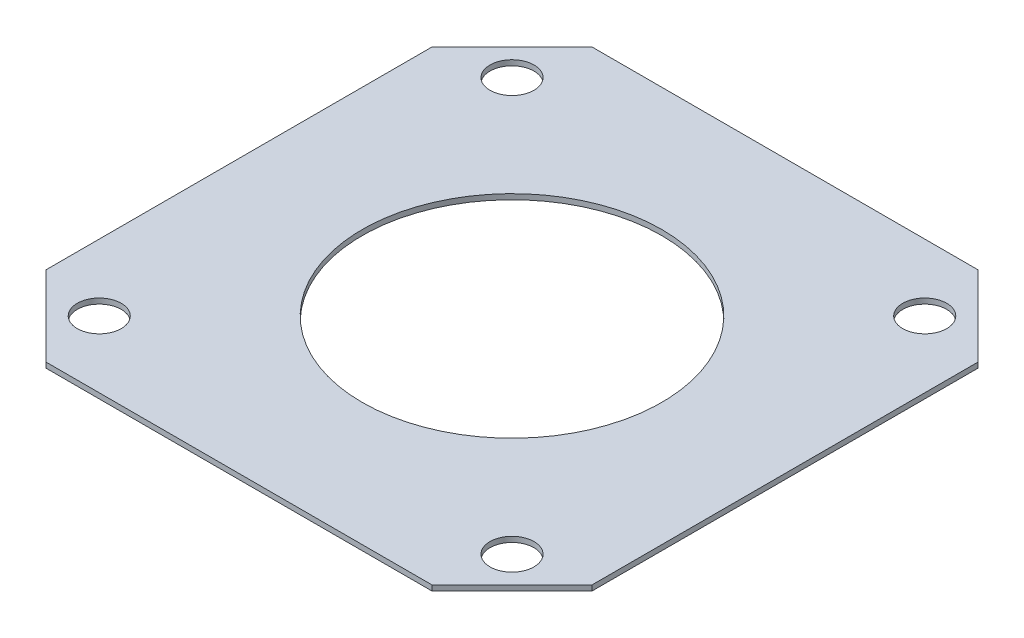
ISO-10303-21;
HEADER;
FILE_DESCRIPTION(('STEP AP214'),'2;1');
FILE_NAME('part.step','',(''),(''),'','','');
FILE_SCHEMA(('AUTOMOTIVE_DESIGN { 1 0 10303 214 1 1 1 1 }'));
ENDSEC;
DATA;
#1=APPLICATION_CONTEXT('core data for automotive mechanical design processes');
#2=APPLICATION_PROTOCOL_DEFINITION('international standard','automotive_design',2000,#1);
#3=PRODUCT_CONTEXT('',#1,'mechanical');
#4=PRODUCT('Part','Part','',(#3));
#5=PRODUCT_RELATED_PRODUCT_CATEGORY('part','',(#4));
#6=PRODUCT_DEFINITION_FORMATION('','',#4);
#7=PRODUCT_DEFINITION_CONTEXT('part definition',#1,'design');
#8=PRODUCT_DEFINITION('design','',#6,#7);
#9=PRODUCT_DEFINITION_SHAPE('','',#8);
#10=(LENGTH_UNIT() NAMED_UNIT(*) SI_UNIT(.MILLI.,.METRE.));
#11=(NAMED_UNIT(*) PLANE_ANGLE_UNIT() SI_UNIT($,.RADIAN.));
#12=(NAMED_UNIT(*) SI_UNIT($,.STERADIAN.) SOLID_ANGLE_UNIT());
#13=UNCERTAINTY_MEASURE_WITH_UNIT(LENGTH_MEASURE(1.E-05),#10,'distance_accuracy_value','');
#14=(GEOMETRIC_REPRESENTATION_CONTEXT(3) GLOBAL_UNCERTAINTY_ASSIGNED_CONTEXT((#13)) GLOBAL_UNIT_ASSIGNED_CONTEXT((#10,
#11,#12)) REPRESENTATION_CONTEXT('',''));
#15=CARTESIAN_POINT('',(0.,0.,0.));
#16=DIRECTION('',(0.,0.,1.));
#17=DIRECTION('',(1.,0.,0.));
#18=AXIS2_PLACEMENT_3D('',#15,#16,#17);
#19=CARTESIAN_POINT('',(0.,0.4,0.));
#20=DIRECTION('',(0.,1.,0.));
#21=DIRECTION('',(0.,0.,1.));
#22=AXIS2_PLACEMENT_3D('',#19,#20,#21);
#23=PLANE('',#22);
#24=CARTESIAN_POINT('',(15.4999999999999,0.4,-15.5000000000001));
#25=DIRECTION('',(0.,1.,0.));
#26=DIRECTION('',(0.,0.,1.));
#27=AXIS2_PLACEMENT_3D('',#24,#25,#26);
#28=CIRCLE('',#27,1.65000000000013);
#29=CARTESIAN_POINT('',(15.4999999999999,0.4,-13.85));
#30=VERTEX_POINT('',#29);
#31=EDGE_CURVE('E198',#30,#30,#28,.T.);
#32=ORIENTED_EDGE('',*,*,#31,.F.);
#33=EDGE_LOOP('',(#32));
#34=FACE_BOUND('',#33,.T.);
#35=CARTESIAN_POINT('',(-15.4999999999999,0.4,15.5000000000001));
#36=DIRECTION('',(0.,1.,0.));
#37=DIRECTION('',(0.,0.,1.));
#38=AXIS2_PLACEMENT_3D('',#35,#36,#37);
#39=CIRCLE('',#38,1.65000000000007);
#40=CARTESIAN_POINT('',(-15.4999999999999,0.4,17.1500000000002));
#41=VERTEX_POINT('',#40);
#42=EDGE_CURVE('E187',#41,#41,#39,.T.);
#43=ORIENTED_EDGE('',*,*,#42,.F.);
#44=EDGE_LOOP('',(#43));
#45=FACE_BOUND('',#44,.T.);
#46=DIRECTION('',(1.,0.,0.));
#47=VECTOR('',#46,1.);
#48=CARTESIAN_POINT('',(20.5000000000001,0.4,20.4999999999999));
#49=LINE('',#48,#47);
#50=CARTESIAN_POINT('',(-14.4999999999999,0.4,20.5000000000001));
#51=VERTEX_POINT('',#50);
#52=CARTESIAN_POINT('',(14.5000000000001,0.4,20.4999999999999));
#53=VERTEX_POINT('',#52);
#54=EDGE_CURVE('E182',#51,#53,#49,.T.);
#55=ORIENTED_EDGE('',*,*,#54,.T.);
#56=DIRECTION('',(-0.707106781186544,0.,0.707106781186551));
#57=VECTOR('',#56,1.);
#58=CARTESIAN_POINT('',(17.5000000000001,0.4,17.4999999999999));
#59=LINE('',#58,#57);
#60=CARTESIAN_POINT('',(20.5000000000001,0.4,14.4999999999999));
#61=VERTEX_POINT('',#60);
#62=EDGE_CURVE('E159',#53,#61,#59,.F.);
#63=ORIENTED_EDGE('',*,*,#62,.T.);
#64=DIRECTION('',(0.,0.,-1.));
#65=VECTOR('',#64,1.);
#66=CARTESIAN_POINT('',(20.5000000000001,0.4,20.4999999999999));
#67=LINE('',#66,#65);
#68=CARTESIAN_POINT('',(20.4999999999999,0.4,-14.5000000000004));
#69=VERTEX_POINT('',#68);
#70=EDGE_CURVE('E129',#61,#69,#67,.T.);
#71=ORIENTED_EDGE('',*,*,#70,.T.);
#72=DIRECTION('',(0.707106781186551,0.,0.707106781186544));
#73=VECTOR('',#72,1.);
#74=CARTESIAN_POINT('',(17.5000000000001,0.4,-17.5000000000002));
#75=LINE('',#74,#73);
#76=CARTESIAN_POINT('',(14.4999999999999,0.4,-20.5000000000004));
#77=VERTEX_POINT('',#76);
#78=EDGE_CURVE('E66',#69,#77,#75,.F.);
#79=ORIENTED_EDGE('',*,*,#78,.T.);
#80=DIRECTION('',(-1.,0.,0.));
#81=VECTOR('',#80,1.);
#82=CARTESIAN_POINT('',(20.4999999999999,0.4,-20.5000000000004));
#83=LINE('',#82,#81);
#84=CARTESIAN_POINT('',(-14.5000000000001,0.4,-20.4999999999999));
#85=VERTEX_POINT('',#84);
#86=EDGE_CURVE('E145',#77,#85,#83,.T.);
#87=ORIENTED_EDGE('',*,*,#86,.T.);
#88=DIRECTION('',(0.707106781186538,0.,-0.707106781186557));
#89=VECTOR('',#88,1.);
#90=CARTESIAN_POINT('',(-17.5000000000002,0.4,-17.4999999999998));
#91=LINE('',#90,#89);
#92=CARTESIAN_POINT('',(-20.5000000000001,0.4,-14.4999999999998));
#93=VERTEX_POINT('',#92);
#94=EDGE_CURVE('E154',#85,#93,#91,.F.);
#95=ORIENTED_EDGE('',*,*,#94,.T.);
#96=DIRECTION('',(0.,0.,1.));
#97=VECTOR('',#96,1.);
#98=CARTESIAN_POINT('',(-20.4999999999999,0.4,20.5000000000001));
#99=LINE('',#98,#97);
#100=CARTESIAN_POINT('',(-20.4999999999999,0.4,14.5000000000001));
#101=VERTEX_POINT('',#100);
#102=EDGE_CURVE('E139',#93,#101,#99,.T.);
#103=ORIENTED_EDGE('',*,*,#102,.T.);
#104=DIRECTION('',(-0.707106781186551,0.,-0.707106781186544));
#105=VECTOR('',#104,1.);
#106=CARTESIAN_POINT('',(-17.4999999999999,0.4,17.5000000000001));
#107=LINE('',#106,#105);
#108=EDGE_CURVE('E156',#101,#51,#107,.F.);
#109=ORIENTED_EDGE('',*,*,#108,.T.);
#110=EDGE_LOOP('',(#55,#63,#71,#79,#87,#95,#103,#109));
#111=FACE_BOUND('',#110,.T.);
#112=CARTESIAN_POINT('',(0.,0.4,0.));
#113=DIRECTION('',(0.,1.,0.));
#114=DIRECTION('',(0.,0.,1.));
#115=AXIS2_PLACEMENT_3D('',#112,#113,#114);
#116=CIRCLE('',#115,11.25);
#117=CARTESIAN_POINT('',(0.,0.4,11.25));
#118=VERTEX_POINT('',#117);
#119=EDGE_CURVE('E175',#118,#118,#116,.T.);
#120=ORIENTED_EDGE('',*,*,#119,.F.);
#121=EDGE_LOOP('',(#120));
#122=FACE_BOUND('',#121,.T.);
#123=CARTESIAN_POINT('',(15.5000000000001,0.4,15.4999999999999));
#124=DIRECTION('',(0.,1.,0.));
#125=DIRECTION('',(0.,0.,1.));
#126=AXIS2_PLACEMENT_3D('',#123,#124,#125);
#127=CIRCLE('',#126,1.65);
#128=CARTESIAN_POINT('',(15.5000000000001,0.4,17.1499999999999));
#129=VERTEX_POINT('',#128);
#130=EDGE_CURVE('E192',#129,#129,#127,.T.);
#131=ORIENTED_EDGE('',*,*,#130,.F.);
#132=EDGE_LOOP('',(#131));
#133=FACE_BOUND('',#132,.T.);
#134=CARTESIAN_POINT('',(-15.5000000000001,0.4,-15.4999999999999));
#135=DIRECTION('',(0.,1.,0.));
#136=DIRECTION('',(0.,0.,1.));
#137=AXIS2_PLACEMENT_3D('',#134,#135,#136);
#138=CIRCLE('',#137,1.64999999999993);
#139=CARTESIAN_POINT('',(-15.5000000000001,0.4,-13.85));
#140=VERTEX_POINT('',#139);
#141=EDGE_CURVE('E204',#140,#140,#138,.T.);
#142=ORIENTED_EDGE('',*,*,#141,.F.);
#143=EDGE_LOOP('',(#142));
#144=FACE_BOUND('',#143,.T.);
#145=ADVANCED_FACE('F43',(#34,#45,#111,#122,#133,#144),#23,.T.);
#146=CARTESIAN_POINT('',(0.,0.,0.));
#147=DIRECTION('',(0.,1.,0.));
#148=DIRECTION('',(0.,0.,1.));
#149=AXIS2_PLACEMENT_3D('',#146,#147,#148);
#150=PLANE('',#149);
#151=DIRECTION('',(0.,0.,-1.));
#152=VECTOR('',#151,1.);
#153=CARTESIAN_POINT('',(20.5000000000001,0.,20.4999999999999));
#154=LINE('',#153,#152);
#155=CARTESIAN_POINT('',(20.5000000000001,0.,14.4999999999999));
#156=VERTEX_POINT('',#155);
#157=CARTESIAN_POINT('',(20.4999999999999,0.,-14.5000000000004));
#158=VERTEX_POINT('',#157);
#159=EDGE_CURVE('E127',#156,#158,#154,.T.);
#160=ORIENTED_EDGE('',*,*,#159,.F.);
#161=DIRECTION('',(0.707106781186544,0.,-0.707106781186551));
#162=VECTOR('',#161,1.);
#163=CARTESIAN_POINT('',(20.5000000000001,0.,14.4999999999999));
#164=LINE('',#163,#162);
#165=CARTESIAN_POINT('',(14.5000000000001,0.,20.4999999999999));
#166=VERTEX_POINT('',#165);
#167=EDGE_CURVE('E110',#156,#166,#164,.F.);
#168=ORIENTED_EDGE('',*,*,#167,.T.);
#169=DIRECTION('',(1.,0.,0.));
#170=VECTOR('',#169,1.);
#171=CARTESIAN_POINT('',(20.5000000000001,0.,20.4999999999999));
#172=LINE('',#171,#170);
#173=CARTESIAN_POINT('',(-14.4999999999999,0.,20.5000000000001));
#174=VERTEX_POINT('',#173);
#175=EDGE_CURVE('E137',#174,#166,#172,.T.);
#176=ORIENTED_EDGE('',*,*,#175,.F.);
#177=DIRECTION('',(0.707106781186551,0.,0.707106781186544));
#178=VECTOR('',#177,1.);
#179=CARTESIAN_POINT('',(-14.4999999999999,0.,20.5000000000001));
#180=LINE('',#179,#178);
#181=CARTESIAN_POINT('',(-20.4999999999999,0.,14.5000000000001));
#182=VERTEX_POINT('',#181);
#183=EDGE_CURVE('E148',#174,#182,#180,.F.);
#184=ORIENTED_EDGE('',*,*,#183,.T.);
#185=DIRECTION('',(0.,0.,1.));
#186=VECTOR('',#185,1.);
#187=CARTESIAN_POINT('',(-20.4999999999999,0.,20.5000000000001));
#188=LINE('',#187,#186);
#189=CARTESIAN_POINT('',(-20.5000000000001,0.,-14.4999999999998));
#190=VERTEX_POINT('',#189);
#191=EDGE_CURVE('E141',#190,#182,#188,.T.);
#192=ORIENTED_EDGE('',*,*,#191,.F.);
#193=DIRECTION('',(-0.707106781186538,0.,0.707106781186557));
#194=VECTOR('',#193,1.);
#195=CARTESIAN_POINT('',(-20.5000000000001,0.,-14.4999999999998));
#196=LINE('',#195,#194);
#197=CARTESIAN_POINT('',(-14.5000000000001,0.,-20.4999999999999));
#198=VERTEX_POINT('',#197);
#199=EDGE_CURVE('E130',#190,#198,#196,.F.);
#200=ORIENTED_EDGE('',*,*,#199,.T.);
#201=DIRECTION('',(-1.,0.,0.));
#202=VECTOR('',#201,1.);
#203=CARTESIAN_POINT('',(20.4999999999999,0.,-20.5000000000004));
#204=LINE('',#203,#202);
#205=CARTESIAN_POINT('',(14.4999999999999,0.,-20.5000000000004));
#206=VERTEX_POINT('',#205);
#207=EDGE_CURVE('E136',#206,#198,#204,.T.);
#208=ORIENTED_EDGE('',*,*,#207,.F.);
#209=DIRECTION('',(-0.707106781186551,0.,-0.707106781186544));
#210=VECTOR('',#209,1.);
#211=CARTESIAN_POINT('',(14.4999999999999,0.,-20.5000000000004));
#212=LINE('',#211,#210);
#213=EDGE_CURVE('E121',#206,#158,#212,.F.);
#214=ORIENTED_EDGE('',*,*,#213,.T.);
#215=EDGE_LOOP('',(#160,#168,#176,#184,#192,#200,#208,#214));
#216=FACE_BOUND('',#215,.T.);
#217=CARTESIAN_POINT('',(0.,0.,0.));
#218=DIRECTION('',(0.,1.,0.));
#219=DIRECTION('',(0.,0.,1.));
#220=AXIS2_PLACEMENT_3D('',#217,#218,#219);
#221=CIRCLE('',#220,11.25);
#222=CARTESIAN_POINT('',(0.,0.,11.25));
#223=VERTEX_POINT('',#222);
#224=EDGE_CURVE('E177',#223,#223,#221,.T.);
#225=ORIENTED_EDGE('',*,*,#224,.T.);
#226=EDGE_LOOP('',(#225));
#227=FACE_BOUND('',#226,.T.);
#228=CARTESIAN_POINT('',(-15.4999999999999,0.,15.5000000000001));
#229=DIRECTION('',(0.,1.,0.));
#230=DIRECTION('',(0.,0.,1.));
#231=AXIS2_PLACEMENT_3D('',#228,#229,#230);
#232=CIRCLE('',#231,1.65000000000007);
#233=CARTESIAN_POINT('',(-15.4999999999999,0.,17.1500000000002));
#234=VERTEX_POINT('',#233);
#235=EDGE_CURVE('E189',#234,#234,#232,.T.);
#236=ORIENTED_EDGE('',*,*,#235,.T.);
#237=EDGE_LOOP('',(#236));
#238=FACE_BOUND('',#237,.T.);
#239=CARTESIAN_POINT('',(15.5000000000001,0.,15.4999999999999));
#240=DIRECTION('',(0.,1.,0.));
#241=DIRECTION('',(0.,0.,1.));
#242=AXIS2_PLACEMENT_3D('',#239,#240,#241);
#243=CIRCLE('',#242,1.65);
#244=CARTESIAN_POINT('',(15.5000000000001,0.,17.1499999999999));
#245=VERTEX_POINT('',#244);
#246=EDGE_CURVE('E195',#245,#245,#243,.T.);
#247=ORIENTED_EDGE('',*,*,#246,.T.);
#248=EDGE_LOOP('',(#247));
#249=FACE_BOUND('',#248,.T.);
#250=CARTESIAN_POINT('',(15.4999999999999,0.,-15.5000000000001));
#251=DIRECTION('',(0.,1.,0.));
#252=DIRECTION('',(0.,0.,1.));
#253=AXIS2_PLACEMENT_3D('',#250,#251,#252);
#254=CIRCLE('',#253,1.65000000000013);
#255=CARTESIAN_POINT('',(15.4999999999999,0.,-13.85));
#256=VERTEX_POINT('',#255);
#257=EDGE_CURVE('E201',#256,#256,#254,.T.);
#258=ORIENTED_EDGE('',*,*,#257,.T.);
#259=EDGE_LOOP('',(#258));
#260=FACE_BOUND('',#259,.T.);
#261=CARTESIAN_POINT('',(-15.5000000000001,0.,-15.4999999999999));
#262=DIRECTION('',(0.,1.,0.));
#263=DIRECTION('',(0.,0.,1.));
#264=AXIS2_PLACEMENT_3D('',#261,#262,#263);
#265=CIRCLE('',#264,1.64999999999993);
#266=CARTESIAN_POINT('',(-15.5000000000001,0.,-13.85));
#267=VERTEX_POINT('',#266);
#268=EDGE_CURVE('E207',#267,#267,#265,.T.);
#269=ORIENTED_EDGE('',*,*,#268,.T.);
#270=EDGE_LOOP('',(#269));
#271=FACE_BOUND('',#270,.T.);
#272=ADVANCED_FACE('F133',(#216,#227,#238,#249,#260,#271),#150,.F.);
#273=CARTESIAN_POINT('',(-20.4999999999999,0.4,20.5000000000001));
#274=DIRECTION('',(1.,0.,0.));
#275=DIRECTION('',(0.,0.,-1.));
#276=AXIS2_PLACEMENT_3D('',#273,#274,#275);
#277=PLANE('',#276);
#278=ORIENTED_EDGE('',*,*,#191,.T.);
#279=DIRECTION('',(0.,1.,0.));
#280=VECTOR('',#279,1.);
#281=CARTESIAN_POINT('',(-20.4999999999999,0.4,14.5000000000001));
#282=LINE('',#281,#280);
#283=EDGE_CURVE('E11',#182,#101,#282,.T.);
#284=ORIENTED_EDGE('',*,*,#283,.T.);
#285=ORIENTED_EDGE('',*,*,#102,.F.);
#286=DIRECTION('',(0.,-1.,0.));
#287=VECTOR('',#286,1.);
#288=CARTESIAN_POINT('',(-20.5000000000001,0.4,-14.4999999999998));
#289=LINE('',#288,#287);
#290=EDGE_CURVE('E52',#93,#190,#289,.T.);
#291=ORIENTED_EDGE('',*,*,#290,.T.);
#292=EDGE_LOOP('',(#278,#284,#285,#291));
#293=FACE_BOUND('',#292,.T.);
#294=ADVANCED_FACE('F170',(#293),#277,.F.);
#295=CARTESIAN_POINT('',(20.5000000000001,0.4,20.4999999999999));
#296=DIRECTION('',(0.,0.,-1.));
#297=DIRECTION('',(-1.,0.,0.));
#298=AXIS2_PLACEMENT_3D('',#295,#296,#297);
#299=PLANE('',#298);
#300=ORIENTED_EDGE('',*,*,#175,.T.);
#301=DIRECTION('',(0.,1.,0.));
#302=VECTOR('',#301,1.);
#303=CARTESIAN_POINT('',(14.5000000000001,0.4,20.4999999999999));
#304=LINE('',#303,#302);
#305=EDGE_CURVE('E115',#166,#53,#304,.T.);
#306=ORIENTED_EDGE('',*,*,#305,.T.);
#307=ORIENTED_EDGE('',*,*,#54,.F.);
#308=DIRECTION('',(0.,-1.,0.));
#309=VECTOR('',#308,1.);
#310=CARTESIAN_POINT('',(-14.4999999999999,0.4,20.5000000000001));
#311=LINE('',#310,#309);
#312=EDGE_CURVE('E120',#51,#174,#311,.T.);
#313=ORIENTED_EDGE('',*,*,#312,.T.);
#314=EDGE_LOOP('',(#300,#306,#307,#313));
#315=FACE_BOUND('',#314,.T.);
#316=ADVANCED_FACE('F235',(#315),#299,.F.);
#317=CARTESIAN_POINT('',(20.5000000000001,0.4,20.4999999999999));
#318=DIRECTION('',(-1.,0.,0.));
#319=DIRECTION('',(0.,0.,1.));
#320=AXIS2_PLACEMENT_3D('',#317,#318,#319);
#321=PLANE('',#320);
#322=ORIENTED_EDGE('',*,*,#70,.F.);
#323=DIRECTION('',(0.,-1.,0.));
#324=VECTOR('',#323,1.);
#325=CARTESIAN_POINT('',(20.5000000000001,0.4,14.4999999999999));
#326=LINE('',#325,#324);
#327=EDGE_CURVE('E114',#61,#156,#326,.T.);
#328=ORIENTED_EDGE('',*,*,#327,.T.);
#329=ORIENTED_EDGE('',*,*,#159,.T.);
#330=DIRECTION('',(0.,1.,0.));
#331=VECTOR('',#330,1.);
#332=CARTESIAN_POINT('',(20.4999999999999,0.4,-14.5000000000004));
#333=LINE('',#332,#331);
#334=EDGE_CURVE('E131',#158,#69,#333,.T.);
#335=ORIENTED_EDGE('',*,*,#334,.T.);
#336=EDGE_LOOP('',(#322,#328,#329,#335));
#337=FACE_BOUND('',#336,.T.);
#338=ADVANCED_FACE('F126',(#337),#321,.F.);
#339=CARTESIAN_POINT('',(20.4999999999999,0.4,-20.5000000000004));
#340=DIRECTION('',(0.,0.,1.));
#341=DIRECTION('',(1.,0.,0.));
#342=AXIS2_PLACEMENT_3D('',#339,#340,#341);
#343=PLANE('',#342);
#344=ORIENTED_EDGE('',*,*,#86,.F.);
#345=DIRECTION('',(0.,-1.,0.));
#346=VECTOR('',#345,1.);
#347=CARTESIAN_POINT('',(14.4999999999999,0.4,-20.5000000000004));
#348=LINE('',#347,#346);
#349=EDGE_CURVE('E162',#77,#206,#348,.T.);
#350=ORIENTED_EDGE('',*,*,#349,.T.);
#351=ORIENTED_EDGE('',*,*,#207,.T.);
#352=DIRECTION('',(0.,1.,0.));
#353=VECTOR('',#352,1.);
#354=CARTESIAN_POINT('',(-14.5000000000001,0.4,-20.4999999999999));
#355=LINE('',#354,#353);
#356=EDGE_CURVE('E59',#198,#85,#355,.T.);
#357=ORIENTED_EDGE('',*,*,#356,.T.);
#358=EDGE_LOOP('',(#344,#350,#351,#357));
#359=FACE_BOUND('',#358,.T.);
#360=ADVANCED_FACE('F230',(#359),#343,.F.);
#361=CARTESIAN_POINT('',(0.,0.4,0.));
#362=DIRECTION('',(0.,-1.,0.));
#363=DIRECTION('',(0.,0.,-1.));
#364=AXIS2_PLACEMENT_3D('',#361,#362,#363);
#365=CYLINDRICAL_SURFACE('',#364,11.25);
#366=ORIENTED_EDGE('',*,*,#119,.T.);
#367=EDGE_LOOP('',(#366));
#368=FACE_BOUND('',#367,.T.);
#369=ORIENTED_EDGE('',*,*,#224,.F.);
#370=EDGE_LOOP('',(#369));
#371=FACE_BOUND('',#370,.T.);
#372=ADVANCED_FACE('F227',(#368,#371),#365,.F.);
#373=CARTESIAN_POINT('',(-15.4999999999999,0.4,15.5000000000001));
#374=DIRECTION('',(0.,-1.,0.));
#375=DIRECTION('',(0.,0.,-1.));
#376=AXIS2_PLACEMENT_3D('',#373,#374,#375);
#377=CYLINDRICAL_SURFACE('',#376,1.65000000000007);
#378=ORIENTED_EDGE('',*,*,#42,.T.);
#379=EDGE_LOOP('',(#378));
#380=FACE_BOUND('',#379,.T.);
#381=ORIENTED_EDGE('',*,*,#235,.F.);
#382=EDGE_LOOP('',(#381));
#383=FACE_BOUND('',#382,.T.);
#384=ADVANCED_FACE('F274',(#380,#383),#377,.F.);
#385=CARTESIAN_POINT('',(15.5000000000001,0.4,15.4999999999999));
#386=DIRECTION('',(0.,-1.,0.));
#387=DIRECTION('',(0.,0.,-1.));
#388=AXIS2_PLACEMENT_3D('',#385,#386,#387);
#389=CYLINDRICAL_SURFACE('',#388,1.65);
#390=ORIENTED_EDGE('',*,*,#130,.T.);
#391=EDGE_LOOP('',(#390));
#392=FACE_BOUND('',#391,.T.);
#393=ORIENTED_EDGE('',*,*,#246,.F.);
#394=EDGE_LOOP('',(#393));
#395=FACE_BOUND('',#394,.T.);
#396=ADVANCED_FACE('F270',(#392,#395),#389,.F.);
#397=CARTESIAN_POINT('',(15.4999999999999,0.4,-15.5000000000001));
#398=DIRECTION('',(0.,-1.,0.));
#399=DIRECTION('',(0.,0.,-1.));
#400=AXIS2_PLACEMENT_3D('',#397,#398,#399);
#401=CYLINDRICAL_SURFACE('',#400,1.65000000000013);
#402=ORIENTED_EDGE('',*,*,#31,.T.);
#403=EDGE_LOOP('',(#402));
#404=FACE_BOUND('',#403,.T.);
#405=ORIENTED_EDGE('',*,*,#257,.F.);
#406=EDGE_LOOP('',(#405));
#407=FACE_BOUND('',#406,.T.);
#408=ADVANCED_FACE('F273',(#404,#407),#401,.F.);
#409=CARTESIAN_POINT('',(-15.5000000000001,0.4,-15.4999999999999));
#410=DIRECTION('',(0.,-1.,0.));
#411=DIRECTION('',(0.,0.,-1.));
#412=AXIS2_PLACEMENT_3D('',#409,#410,#411);
#413=CYLINDRICAL_SURFACE('',#412,1.64999999999993);
#414=ORIENTED_EDGE('',*,*,#141,.T.);
#415=EDGE_LOOP('',(#414));
#416=FACE_BOUND('',#415,.T.);
#417=ORIENTED_EDGE('',*,*,#268,.F.);
#418=EDGE_LOOP('',(#417));
#419=FACE_BOUND('',#418,.T.);
#420=ADVANCED_FACE('F213',(#416,#419),#413,.F.);
#421=CARTESIAN_POINT('',(20.5000000000001,0.4,14.4999999999999));
#422=DIRECTION('',(-0.707106781186551,0.,-0.707106781186544));
#423=DIRECTION('',(0.,-1.,0.));
#424=AXIS2_PLACEMENT_3D('',#421,#422,#423);
#425=PLANE('',#424);
#426=ORIENTED_EDGE('',*,*,#62,.F.);
#427=ORIENTED_EDGE('',*,*,#305,.F.);
#428=ORIENTED_EDGE('',*,*,#167,.F.);
#429=ORIENTED_EDGE('',*,*,#327,.F.);
#430=EDGE_LOOP('',(#426,#427,#428,#429));
#431=FACE_BOUND('',#430,.T.);
#432=ADVANCED_FACE('F113',(#431),#425,.F.);
#433=CARTESIAN_POINT('',(14.4999999999999,0.4,-20.5000000000004));
#434=DIRECTION('',(-0.707106781186544,0.,0.707106781186551));
#435=DIRECTION('',(0.,-1.,0.));
#436=AXIS2_PLACEMENT_3D('',#433,#434,#435);
#437=PLANE('',#436);
#438=ORIENTED_EDGE('',*,*,#78,.F.);
#439=ORIENTED_EDGE('',*,*,#334,.F.);
#440=ORIENTED_EDGE('',*,*,#213,.F.);
#441=ORIENTED_EDGE('',*,*,#349,.F.);
#442=EDGE_LOOP('',(#438,#439,#440,#441));
#443=FACE_BOUND('',#442,.T.);
#444=ADVANCED_FACE('F247',(#443),#437,.F.);
#445=CARTESIAN_POINT('',(-14.4999999999999,0.4,20.5000000000001));
#446=DIRECTION('',(0.707106781186544,0.,-0.707106781186551));
#447=DIRECTION('',(0.,-1.,0.));
#448=AXIS2_PLACEMENT_3D('',#445,#446,#447);
#449=PLANE('',#448);
#450=ORIENTED_EDGE('',*,*,#108,.F.);
#451=ORIENTED_EDGE('',*,*,#283,.F.);
#452=ORIENTED_EDGE('',*,*,#183,.F.);
#453=ORIENTED_EDGE('',*,*,#312,.F.);
#454=EDGE_LOOP('',(#450,#451,#452,#453));
#455=FACE_BOUND('',#454,.T.);
#456=ADVANCED_FACE('F252',(#455),#449,.F.);
#457=CARTESIAN_POINT('',(-20.5000000000001,0.4,-14.4999999999998));
#458=DIRECTION('',(0.707106781186557,0.,0.707106781186538));
#459=DIRECTION('',(0.,-1.,0.));
#460=AXIS2_PLACEMENT_3D('',#457,#458,#459);
#461=PLANE('',#460);
#462=ORIENTED_EDGE('',*,*,#94,.F.);
#463=ORIENTED_EDGE('',*,*,#356,.F.);
#464=ORIENTED_EDGE('',*,*,#199,.F.);
#465=ORIENTED_EDGE('',*,*,#290,.F.);
#466=EDGE_LOOP('',(#462,#463,#464,#465));
#467=FACE_BOUND('',#466,.T.);
#468=ADVANCED_FACE('F46',(#467),#461,.F.);
#469=CLOSED_SHELL('',(#145,#272,#294,#316,#338,#360,#372,#384,#396,#408,#420,#432,#444,#456,#468));
#470=MANIFOLD_SOLID_BREP('B2',#469);
#471=ADVANCED_BREP_SHAPE_REPRESENTATION('',(#18,#470),#14);
#472=SHAPE_DEFINITION_REPRESENTATION(#9,#471);
ENDSEC;
END-ISO-10303-21;
